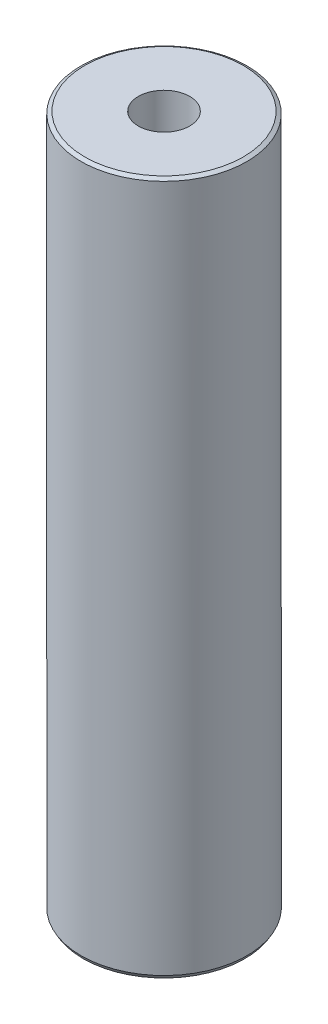
ISO-10303-21;
HEADER;
FILE_DESCRIPTION(('STEP AP214'),'2;1');
FILE_NAME('part.step','',(''),(''),'','','');
FILE_SCHEMA(('AUTOMOTIVE_DESIGN { 1 0 10303 214 1 1 1 1 }'));
ENDSEC;
DATA;
#1=APPLICATION_CONTEXT('core data for automotive mechanical design processes');
#2=APPLICATION_PROTOCOL_DEFINITION('international standard','automotive_design',2000,#1);
#3=PRODUCT_CONTEXT('',#1,'mechanical');
#4=PRODUCT('Part','Part','',(#3));
#5=PRODUCT_RELATED_PRODUCT_CATEGORY('part','',(#4));
#6=PRODUCT_DEFINITION_FORMATION('','',#4);
#7=PRODUCT_DEFINITION_CONTEXT('part definition',#1,'design');
#8=PRODUCT_DEFINITION('design','',#6,#7);
#9=PRODUCT_DEFINITION_SHAPE('','',#8);
#10=(LENGTH_UNIT() NAMED_UNIT(*) SI_UNIT(.MILLI.,.METRE.));
#11=(NAMED_UNIT(*) PLANE_ANGLE_UNIT() SI_UNIT($,.RADIAN.));
#12=(NAMED_UNIT(*) SI_UNIT($,.STERADIAN.) SOLID_ANGLE_UNIT());
#13=UNCERTAINTY_MEASURE_WITH_UNIT(LENGTH_MEASURE(1.E-05),#10,'distance_accuracy_value','');
#14=(GEOMETRIC_REPRESENTATION_CONTEXT(3) GLOBAL_UNCERTAINTY_ASSIGNED_CONTEXT((#13)) GLOBAL_UNIT_ASSIGNED_CONTEXT((#10,
#11,#12)) REPRESENTATION_CONTEXT('',''));
#15=CARTESIAN_POINT('',(0.,0.,0.));
#16=DIRECTION('',(0.,0.,1.));
#17=DIRECTION('',(1.,0.,0.));
#18=AXIS2_PLACEMENT_3D('',#15,#16,#17);
#19=CARTESIAN_POINT('',(0.,250.842656027486,0.));
#20=DIRECTION('',(0.,-1.,0.));
#21=DIRECTION('',(0.,0.,-1.));
#22=AXIS2_PLACEMENT_3D('',#19,#20,#21);
#23=CYLINDRICAL_SURFACE('',#22,30.);
#24=CARTESIAN_POINT('',(0.,250.075342381073,0.));
#25=DIRECTION('',(0.,1.,0.));
#26=DIRECTION('',(0.,0.,1.));
#27=AXIS2_PLACEMENT_3D('',#24,#25,#26);
#28=CIRCLE('',#27,30.);
#29=CARTESIAN_POINT('',(0.,250.075342381073,-30.));
#30=VERTEX_POINT('',#29);
#31=EDGE_CURVE('E50',#30,#30,#28,.F.);
#32=ORIENTED_EDGE('',*,*,#31,.T.);
#33=EDGE_LOOP('',(#32));
#34=FACE_BOUND('',#33,.T.);
#35=CARTESIAN_POINT('',(0.,1.32902622092865,0.));
#36=DIRECTION('',(0.,1.,0.));
#37=DIRECTION('',(0.,0.,1.));
#38=AXIS2_PLACEMENT_3D('',#35,#36,#37);
#39=CIRCLE('',#38,30.);
#40=CARTESIAN_POINT('',(0.,1.32902622092865,30.));
#41=VERTEX_POINT('',#40);
#42=EDGE_CURVE('E51',#41,#41,#39,.T.);
#43=ORIENTED_EDGE('',*,*,#42,.T.);
#44=EDGE_LOOP('',(#43));
#45=FACE_BOUND('',#44,.T.);
#46=ADVANCED_FACE('F39',(#34,#45),#23,.T.);
#47=CARTESIAN_POINT('',(0.,250.842656027486,0.));
#48=DIRECTION('',(0.,1.,0.));
#49=DIRECTION('',(0.,0.,1.));
#50=AXIS2_PLACEMENT_3D('',#47,#48,#49);
#51=PLANE('',#50);
#52=CARTESIAN_POINT('',(0.,250.842656027486,0.));
#53=DIRECTION('',(0.,1.,0.));
#54=DIRECTION('',(0.,0.,1.));
#55=AXIS2_PLACEMENT_3D('',#52,#53,#54);
#56=CIRCLE('',#55,28.6709737790713);
#57=CARTESIAN_POINT('',(0.,250.842656027486,-28.6709737790714));
#58=VERTEX_POINT('',#57);
#59=EDGE_CURVE('E54',#58,#58,#56,.T.);
#60=ORIENTED_EDGE('',*,*,#59,.T.);
#61=EDGE_LOOP('',(#60));
#62=FACE_BOUND('',#61,.T.);
#63=CARTESIAN_POINT('',(0.,250.842656027486,0.));
#64=DIRECTION('',(0.,1.,0.));
#65=DIRECTION('',(0.,0.,1.));
#66=AXIS2_PLACEMENT_3D('',#63,#64,#65);
#67=CIRCLE('',#66,9.29303881089778);
#68=CARTESIAN_POINT('',(0.,250.842656027486,9.29303881089778));
#69=VERTEX_POINT('',#68);
#70=EDGE_CURVE('E58',#69,#69,#67,.T.);
#71=ORIENTED_EDGE('',*,*,#70,.F.);
#72=EDGE_LOOP('',(#71));
#73=FACE_BOUND('',#72,.T.);
#74=ADVANCED_FACE('F69',(#62,#73),#51,.T.);
#75=CARTESIAN_POINT('',(0.,0.,0.));
#76=DIRECTION('',(0.,1.,0.));
#77=DIRECTION('',(0.,0.,1.));
#78=AXIS2_PLACEMENT_3D('',#75,#76,#77);
#79=PLANE('',#78);
#80=CARTESIAN_POINT('',(0.,0.,0.));
#81=DIRECTION('',(0.,1.,0.));
#82=DIRECTION('',(0.,0.,1.));
#83=AXIS2_PLACEMENT_3D('',#80,#81,#82);
#84=CIRCLE('',#83,29.2326863535868);
#85=CARTESIAN_POINT('',(0.,0.,29.2326863535868));
#86=VERTEX_POINT('',#85);
#87=EDGE_CURVE('E10',#86,#86,#84,.F.);
#88=ORIENTED_EDGE('',*,*,#87,.T.);
#89=EDGE_LOOP('',(#88));
#90=FACE_BOUND('',#89,.T.);
#91=CARTESIAN_POINT('',(0.,0.,0.));
#92=DIRECTION('',(0.,1.,0.));
#93=DIRECTION('',(0.,0.,1.));
#94=AXIS2_PLACEMENT_3D('',#91,#92,#93);
#95=CIRCLE('',#94,9.29303881089778);
#96=CARTESIAN_POINT('',(0.,0.,9.29303881089778));
#97=VERTEX_POINT('',#96);
#98=EDGE_CURVE('E63',#97,#97,#95,.T.);
#99=ORIENTED_EDGE('',*,*,#98,.T.);
#100=EDGE_LOOP('',(#99));
#101=FACE_BOUND('',#100,.T.);
#102=ADVANCED_FACE('F75',(#90,#101),#79,.F.);
#103=CARTESIAN_POINT('',(0.,250.842656027486,0.));
#104=DIRECTION('',(0.,-1.,0.));
#105=DIRECTION('',(0.,0.,-1.));
#106=AXIS2_PLACEMENT_3D('',#103,#104,#105);
#107=CYLINDRICAL_SURFACE('',#106,9.29303881089778);
#108=ORIENTED_EDGE('',*,*,#70,.T.);
#109=EDGE_LOOP('',(#108));
#110=FACE_BOUND('',#109,.T.);
#111=ORIENTED_EDGE('',*,*,#98,.F.);
#112=EDGE_LOOP('',(#111));
#113=FACE_BOUND('',#112,.T.);
#114=ADVANCED_FACE('F70',(#110,#113),#107,.F.);
#115=CARTESIAN_POINT('',(0.,250.842656027486,0.));
#116=DIRECTION('',(0.,-1.,0.));
#117=DIRECTION('',(0.,0.,-1.));
#118=AXIS2_PLACEMENT_3D('',#115,#116,#117);
#119=CONICAL_SURFACE('',#118,28.6709737790713,1.04719755119659);
#120=CARTESIAN_POINT('',(0.,250.075342381073,-30.));
#121=CARTESIAN_POINT('',(0.,250.083335231557,-29.9861559768654));
#122=CARTESIAN_POINT('',(0.,250.09132808204,-29.9723119537307));
#123=CARTESIAN_POINT('',(0.,250.107313783007,-29.9446239074614));
#124=CARTESIAN_POINT('',(0.,250.11530663349,-29.9307798843267));
#125=CARTESIAN_POINT('',(0.,250.131292334457,-29.9030918380573));
#126=CARTESIAN_POINT('',(0.,250.139285184941,-29.8892478149227));
#127=CARTESIAN_POINT('',(0.,250.155270885908,-29.8615597686533));
#128=CARTESIAN_POINT('',(0.,250.163263736391,-29.8477157455186));
#129=CARTESIAN_POINT('',(0.,250.179249437358,-29.8200276992493));
#130=CARTESIAN_POINT('',(0.,250.187242287842,-29.8061836761146));
#131=CARTESIAN_POINT('',(0.,250.203227988809,-29.7784956298453));
#132=CARTESIAN_POINT('',(0.,250.211220839292,-29.7646516067106));
#133=CARTESIAN_POINT('',(0.,250.227206540259,-29.7369635604412));
#134=CARTESIAN_POINT('',(0.,250.235199390743,-29.7231195373066));
#135=CARTESIAN_POINT('',(0.,250.251185091709,-29.6954314910372));
#136=CARTESIAN_POINT('',(0.,250.259177942193,-29.6815874679025));
#137=CARTESIAN_POINT('',(0.,250.27516364316,-29.6538994216332));
#138=CARTESIAN_POINT('',(0.,250.283156493643,-29.6400553984985));
#139=CARTESIAN_POINT('',(0.,250.29914219461,-29.6123673522292));
#140=CARTESIAN_POINT('',(0.,250.307135045094,-29.5985233290945));
#141=CARTESIAN_POINT('',(0.,250.323120746061,-29.5708352828252));
#142=CARTESIAN_POINT('',(0.,250.331113596544,-29.5569912596905));
#143=CARTESIAN_POINT('',(0.,250.347099297511,-29.5293032134211));
#144=CARTESIAN_POINT('',(0.,250.355092147995,-29.5154591902865));
#145=CARTESIAN_POINT('',(0.,250.371077848962,-29.4877711440171));
#146=CARTESIAN_POINT('',(0.,250.379070699445,-29.4739271208824));
#147=CARTESIAN_POINT('',(0.,250.395056400412,-29.4462390746131));
#148=CARTESIAN_POINT('',(0.,250.403049250895,-29.4323950514784));
#149=CARTESIAN_POINT('',(0.,250.419034951862,-29.4047070052091));
#150=CARTESIAN_POINT('',(0.,250.427027802346,-29.3908629820744));
#151=CARTESIAN_POINT('',(0.,250.443013503313,-29.3631749358051));
#152=CARTESIAN_POINT('',(0.,250.451006353796,-29.3493309126704));
#153=CARTESIAN_POINT('',(0.,250.466992054763,-29.321642866401));
#154=CARTESIAN_POINT('',(0.,250.474984905247,-29.3077988432664));
#155=CARTESIAN_POINT('',(0.,250.490970606214,-29.280110796997));
#156=CARTESIAN_POINT('',(0.,250.498963456697,-29.2662667738623));
#157=CARTESIAN_POINT('',(0.,250.514949157664,-29.238578727593));
#158=CARTESIAN_POINT('',(0.,250.522942008147,-29.2247347044583));
#159=CARTESIAN_POINT('',(0.,250.538927709114,-29.197046658189));
#160=CARTESIAN_POINT('',(0.,250.546920559598,-29.1832026350543));
#161=CARTESIAN_POINT('',(0.,250.562906260565,-29.155514588785));
#162=CARTESIAN_POINT('',(0.,250.570899111048,-29.1416705656503));
#163=CARTESIAN_POINT('',(0.,250.586884812015,-29.1139825193809));
#164=CARTESIAN_POINT('',(0.,250.594877662499,-29.1001384962463));
#165=CARTESIAN_POINT('',(0.,250.610863363466,-29.0724504499769));
#166=CARTESIAN_POINT('',(0.,250.618856213949,-29.0586064268422));
#167=CARTESIAN_POINT('',(0.,250.634841914916,-29.0309183805729));
#168=CARTESIAN_POINT('',(0.,250.6428347654,-29.0170743574382));
#169=CARTESIAN_POINT('',(0.,250.658820466367,-28.9893863111689));
#170=CARTESIAN_POINT('',(0.,250.66681331685,-28.9755422880342));
#171=CARTESIAN_POINT('',(0.,250.682799017817,-28.9478542417648));
#172=CARTESIAN_POINT('',(0.,250.6907918683,-28.9340102186302));
#173=CARTESIAN_POINT('',(0.,250.706777569267,-28.9063221723608));
#174=CARTESIAN_POINT('',(0.,250.714770419751,-28.8924781492262));
#175=CARTESIAN_POINT('',(0.,250.730756120718,-28.8647901029568));
#176=CARTESIAN_POINT('',(0.,250.738748971201,-28.8509460798221));
#177=CARTESIAN_POINT('',(0.,250.754734672168,-28.8232580335528));
#178=CARTESIAN_POINT('',(0.,250.762727522652,-28.8094140104181));
#179=CARTESIAN_POINT('',(0.,250.778713223619,-28.7817259641488));
#180=CARTESIAN_POINT('',(0.,250.786706074102,-28.7678819410141));
#181=CARTESIAN_POINT('',(0.,250.802691775069,-28.7401938947447));
#182=CARTESIAN_POINT('',(0.,250.810684625552,-28.7263498716101));
#183=CARTESIAN_POINT('',(0.,250.826670326519,-28.6986618253407));
#184=CARTESIAN_POINT('',(0.,250.834663177003,-28.684817802206));
#185=CARTESIAN_POINT('',(0.,250.842656027486,-28.6709737790714));
#186=B_SPLINE_CURVE_WITH_KNOTS('',3,(#120,#121,#122,#123,#124,#125,#126,#127,#128,#129,#130,
#131,#132,#133,#134,#135,#136,#137,#138,#139,#140,#141,#142,#143,#144,#145,#146,#147,#148,#149,
#150,#151,#152,#153,#154,#155,#156,#157,#158,#159,#160,#161,#162,#163,#164,#165,#166,#167,#168,
#169,#170,#171,#172,#173,#174,#175,#176,#177,#178,#179,#180,#181,#182,#183,#184,#185),
.UNSPECIFIED.,.F.,.F.,(4,2,2,2,2,2,2,2,2,2,2,2,2,2,2,2,2,2,2,2,2,2,2,2,2,2,2,2,2,2,2,2,4),(0.,
0.0479571029008312,0.0959142058016623,0.143871308702494,0.191828411603325,0.239785514504156,
0.287742617404987,0.335699720305818,0.383656823206622,0.431613926107453,0.479571029008284,
0.527528131909115,0.575485234809946,0.623442337710778,0.671399440611609,0.71935654351244,
0.767313646413243,0.815270749314074,0.863227852214906,0.911184955115737,0.959142058016568,
1.0070991609174,1.05505626381823,1.10301336671906,1.15097046961989,1.1989275725207,
1.24688467542153,1.29484177832236,1.34279888122319,1.39075598412402,1.43871308702485,
1.48667018992568,1.53462729282651),.UNSPECIFIED.);
#187=EDGE_CURVE('BSEAM81',#30,#58,#186,.T.);
#188=ORIENTED_EDGE('',*,*,#31,.F.);
#189=ORIENTED_EDGE('',*,*,#59,.F.);
#190=ORIENTED_EDGE('',*,*,#187,.T.);
#191=ORIENTED_EDGE('',*,*,#187,.F.);
#192=EDGE_LOOP('',(#188,#190,#189,#191));
#193=FACE_BOUND('',#192,.T.);
#194=ADVANCED_FACE('F81',(#193),#119,.T.);
#195=CARTESIAN_POINT('',(0.,1.32902622092865,0.));
#196=DIRECTION('',(0.,1.,0.));
#197=DIRECTION('',(0.,0.,1.));
#198=AXIS2_PLACEMENT_3D('',#195,#196,#197);
#199=CONICAL_SURFACE('',#198,30.,0.523598775598296);
#200=ORIENTED_EDGE('',*,*,#87,.F.);
#201=EDGE_LOOP('',(#200));
#202=FACE_BOUND('',#201,.T.);
#203=ORIENTED_EDGE('',*,*,#42,.F.);
#204=EDGE_LOOP('',(#203));
#205=FACE_BOUND('',#204,.T.);
#206=ADVANCED_FACE('F45',(#202,#205),#199,.T.);
#207=CLOSED_SHELL('',(#46,#74,#102,#114,#194,#206));
#208=MANIFOLD_SOLID_BREP('B2',#207);
#209=ADVANCED_BREP_SHAPE_REPRESENTATION('',(#18,#208),#14);
#210=SHAPE_DEFINITION_REPRESENTATION(#9,#209);
ENDSEC;
END-ISO-10303-21;
